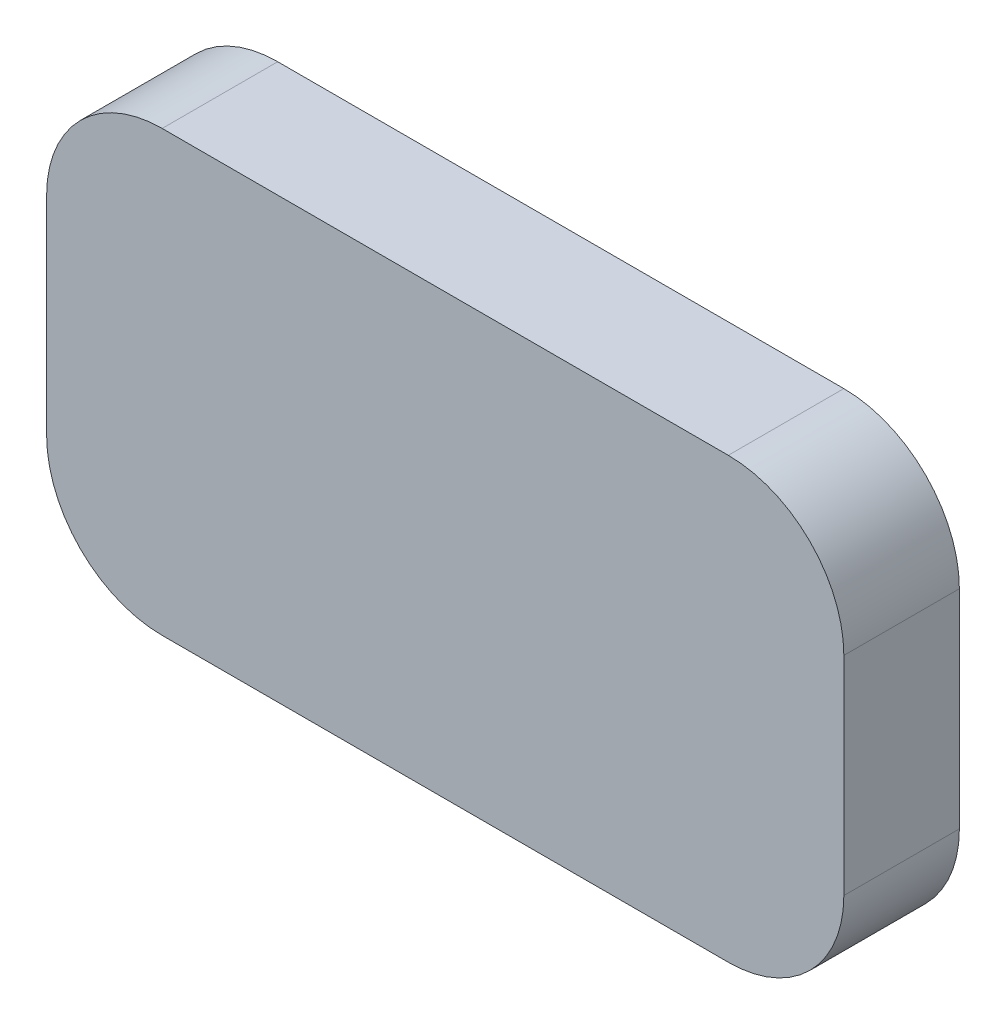
ISO-10303-21;
HEADER;
FILE_DESCRIPTION(('STEP AP214'),'2;1');
FILE_NAME('part.step','',(''),(''),'','','');
FILE_SCHEMA(('AUTOMOTIVE_DESIGN { 1 0 10303 214 1 1 1 1 }'));
ENDSEC;
DATA;
#1=APPLICATION_CONTEXT('core data for automotive mechanical design processes');
#2=APPLICATION_PROTOCOL_DEFINITION('international standard','automotive_design',2000,#1);
#3=PRODUCT_CONTEXT('',#1,'mechanical');
#4=PRODUCT('Part','Part','',(#3));
#5=PRODUCT_RELATED_PRODUCT_CATEGORY('part','',(#4));
#6=PRODUCT_DEFINITION_FORMATION('','',#4);
#7=PRODUCT_DEFINITION_CONTEXT('part definition',#1,'design');
#8=PRODUCT_DEFINITION('design','',#6,#7);
#9=PRODUCT_DEFINITION_SHAPE('','',#8);
#10=(LENGTH_UNIT() NAMED_UNIT(*) SI_UNIT(.MILLI.,.METRE.));
#11=(NAMED_UNIT(*) PLANE_ANGLE_UNIT() SI_UNIT($,.RADIAN.));
#12=(NAMED_UNIT(*) SI_UNIT($,.STERADIAN.) SOLID_ANGLE_UNIT());
#13=UNCERTAINTY_MEASURE_WITH_UNIT(LENGTH_MEASURE(1.E-05),#10,'distance_accuracy_value','');
#14=(GEOMETRIC_REPRESENTATION_CONTEXT(3) GLOBAL_UNCERTAINTY_ASSIGNED_CONTEXT((#13)) GLOBAL_UNIT_ASSIGNED_CONTEXT((#10,
#11,#12)) REPRESENTATION_CONTEXT('',''));
#15=CARTESIAN_POINT('',(0.,0.,0.));
#16=DIRECTION('',(0.,0.,1.));
#17=DIRECTION('',(1.,0.,0.));
#18=AXIS2_PLACEMENT_3D('',#15,#16,#17);
#19=CARTESIAN_POINT('',(0.,0.,10.));
#20=DIRECTION('',(1.,0.,0.));
#21=DIRECTION('',(0.,1.,0.));
#22=AXIS2_PLACEMENT_3D('',#19,#20,#21);
#23=PLANE('',#22);
#24=DIRECTION('',(0.,-1.,0.));
#25=VECTOR('',#24,1.);
#26=CARTESIAN_POINT('',(0.,0.,0.));
#27=LINE('',#26,#25);
#28=CARTESIAN_POINT('',(0.,-10.,0.));
#29=VERTEX_POINT('',#28);
#30=CARTESIAN_POINT('',(0.,-28.,0.));
#31=VERTEX_POINT('',#30);
#32=EDGE_CURVE('E128',#29,#31,#27,.T.);
#33=ORIENTED_EDGE('',*,*,#32,.T.);
#34=DIRECTION('',(0.,0.,-1.));
#35=VECTOR('',#34,1.);
#36=CARTESIAN_POINT('',(0.,-28.,10.));
#37=LINE('',#36,#35);
#38=CARTESIAN_POINT('',(0.,-28.,10.));
#39=VERTEX_POINT('',#38);
#40=EDGE_CURVE('E105',#31,#39,#37,.F.);
#41=ORIENTED_EDGE('',*,*,#40,.T.);
#42=DIRECTION('',(0.,-1.,0.));
#43=VECTOR('',#42,1.);
#44=CARTESIAN_POINT('',(0.,0.,10.));
#45=LINE('',#44,#43);
#46=CARTESIAN_POINT('',(0.,-10.,10.));
#47=VERTEX_POINT('',#46);
#48=EDGE_CURVE('E137',#47,#39,#45,.T.);
#49=ORIENTED_EDGE('',*,*,#48,.F.);
#50=DIRECTION('',(0.,0.,-1.));
#51=VECTOR('',#50,1.);
#52=CARTESIAN_POINT('',(0.,-10.,10.));
#53=LINE('',#52,#51);
#54=EDGE_CURVE('E110',#47,#29,#53,.T.);
#55=ORIENTED_EDGE('',*,*,#54,.T.);
#56=EDGE_LOOP('',(#33,#41,#49,#55));
#57=FACE_BOUND('',#56,.T.);
#58=ADVANCED_FACE('F33',(#57),#23,.F.);
#59=CARTESIAN_POINT('',(0.,-38.,10.));
#60=DIRECTION('',(0.,1.,0.));
#61=DIRECTION('',(0.,0.,1.));
#62=AXIS2_PLACEMENT_3D('',#59,#60,#61);
#63=PLANE('',#62);
#64=DIRECTION('',(1.,0.,0.));
#65=VECTOR('',#64,1.);
#66=CARTESIAN_POINT('',(0.,-38.,10.));
#67=LINE('',#66,#65);
#68=CARTESIAN_POINT('',(10.,-38.,10.));
#69=VERTEX_POINT('',#68);
#70=CARTESIAN_POINT('',(59.,-38.,10.));
#71=VERTEX_POINT('',#70);
#72=EDGE_CURVE('E120',#69,#71,#67,.T.);
#73=ORIENTED_EDGE('',*,*,#72,.F.);
#74=DIRECTION('',(0.,0.,-1.));
#75=VECTOR('',#74,1.);
#76=CARTESIAN_POINT('',(10.,-38.,10.));
#77=LINE('',#76,#75);
#78=CARTESIAN_POINT('',(10.,-38.,0.));
#79=VERTEX_POINT('',#78);
#80=EDGE_CURVE('E104',#69,#79,#77,.T.);
#81=ORIENTED_EDGE('',*,*,#80,.T.);
#82=DIRECTION('',(1.,0.,0.));
#83=VECTOR('',#82,1.);
#84=CARTESIAN_POINT('',(0.,-38.,0.));
#85=LINE('',#84,#83);
#86=CARTESIAN_POINT('',(59.,-38.,0.));
#87=VERTEX_POINT('',#86);
#88=EDGE_CURVE('E117',#79,#87,#85,.T.);
#89=ORIENTED_EDGE('',*,*,#88,.T.);
#90=DIRECTION('',(0.,0.,-1.));
#91=VECTOR('',#90,1.);
#92=CARTESIAN_POINT('',(59.,-38.,10.));
#93=LINE('',#92,#91);
#94=EDGE_CURVE('E122',#87,#71,#93,.F.);
#95=ORIENTED_EDGE('',*,*,#94,.T.);
#96=EDGE_LOOP('',(#73,#81,#89,#95));
#97=FACE_BOUND('',#96,.T.);
#98=ADVANCED_FACE('F116',(#97),#63,.F.);
#99=CARTESIAN_POINT('',(69.,0.,10.));
#100=DIRECTION('',(-1.,0.,0.));
#101=DIRECTION('',(0.,0.,1.));
#102=AXIS2_PLACEMENT_3D('',#99,#100,#101);
#103=PLANE('',#102);
#104=DIRECTION('',(0.,1.,0.));
#105=VECTOR('',#104,1.);
#106=CARTESIAN_POINT('',(69.,0.,10.));
#107=LINE('',#106,#105);
#108=CARTESIAN_POINT('',(69.,-28.,10.));
#109=VERTEX_POINT('',#108);
#110=CARTESIAN_POINT('',(69.,-10.,10.));
#111=VERTEX_POINT('',#110);
#112=EDGE_CURVE('E160',#109,#111,#107,.T.);
#113=ORIENTED_EDGE('',*,*,#112,.F.);
#114=DIRECTION('',(0.,0.,-1.));
#115=VECTOR('',#114,1.);
#116=CARTESIAN_POINT('',(69.,-28.,10.));
#117=LINE('',#116,#115);
#118=CARTESIAN_POINT('',(69.,-28.,0.));
#119=VERTEX_POINT('',#118);
#120=EDGE_CURVE('E11',#109,#119,#117,.T.);
#121=ORIENTED_EDGE('',*,*,#120,.T.);
#122=DIRECTION('',(0.,1.,0.));
#123=VECTOR('',#122,1.);
#124=CARTESIAN_POINT('',(69.,0.,0.));
#125=LINE('',#124,#123);
#126=CARTESIAN_POINT('',(69.,-10.,0.));
#127=VERTEX_POINT('',#126);
#128=EDGE_CURVE('E127',#119,#127,#125,.T.);
#129=ORIENTED_EDGE('',*,*,#128,.T.);
#130=DIRECTION('',(0.,0.,-1.));
#131=VECTOR('',#130,1.);
#132=CARTESIAN_POINT('',(69.,-10.,10.));
#133=LINE('',#132,#131);
#134=EDGE_CURVE('E41',#127,#111,#133,.F.);
#135=ORIENTED_EDGE('',*,*,#134,.T.);
#136=EDGE_LOOP('',(#113,#121,#129,#135));
#137=FACE_BOUND('',#136,.T.);
#138=ADVANCED_FACE('F159',(#137),#103,.F.);
#139=CARTESIAN_POINT('',(0.,0.,10.));
#140=DIRECTION('',(0.,-1.,0.));
#141=DIRECTION('',(0.,0.,-1.));
#142=AXIS2_PLACEMENT_3D('',#139,#140,#141);
#143=PLANE('',#142);
#144=DIRECTION('',(-1.,0.,0.));
#145=VECTOR('',#144,1.);
#146=CARTESIAN_POINT('',(0.,0.,0.));
#147=LINE('',#146,#145);
#148=CARTESIAN_POINT('',(59.,0.,0.));
#149=VERTEX_POINT('',#148);
#150=CARTESIAN_POINT('',(10.,0.,0.));
#151=VERTEX_POINT('',#150);
#152=EDGE_CURVE('E131',#149,#151,#147,.T.);
#153=ORIENTED_EDGE('',*,*,#152,.T.);
#154=DIRECTION('',(0.,0.,-1.));
#155=VECTOR('',#154,1.);
#156=CARTESIAN_POINT('',(10.,0.,10.));
#157=LINE('',#156,#155);
#158=CARTESIAN_POINT('',(10.,0.,10.));
#159=VERTEX_POINT('',#158);
#160=EDGE_CURVE('E48',#151,#159,#157,.F.);
#161=ORIENTED_EDGE('',*,*,#160,.T.);
#162=DIRECTION('',(-1.,0.,0.));
#163=VECTOR('',#162,1.);
#164=CARTESIAN_POINT('',(0.,0.,10.));
#165=LINE('',#164,#163);
#166=CARTESIAN_POINT('',(59.,0.,10.));
#167=VERTEX_POINT('',#166);
#168=EDGE_CURVE('E138',#167,#159,#165,.T.);
#169=ORIENTED_EDGE('',*,*,#168,.F.);
#170=DIRECTION('',(0.,0.,-1.));
#171=VECTOR('',#170,1.);
#172=CARTESIAN_POINT('',(59.,0.,10.));
#173=LINE('',#172,#171);
#174=EDGE_CURVE('E153',#167,#149,#173,.T.);
#175=ORIENTED_EDGE('',*,*,#174,.T.);
#176=EDGE_LOOP('',(#153,#161,#169,#175));
#177=FACE_BOUND('',#176,.T.);
#178=ADVANCED_FACE('F169',(#177),#143,.F.);
#179=CARTESIAN_POINT('',(0.,0.,10.));
#180=DIRECTION('',(0.,0.,1.));
#181=DIRECTION('',(1.,0.,0.));
#182=AXIS2_PLACEMENT_3D('',#179,#180,#181);
#183=PLANE('',#182);
#184=ORIENTED_EDGE('',*,*,#48,.T.);
#185=CARTESIAN_POINT('',(10.,-28.,10.));
#186=DIRECTION('',(0.,0.,1.));
#187=DIRECTION('',(1.,0.,0.));
#188=AXIS2_PLACEMENT_3D('',#185,#186,#187);
#189=CIRCLE('',#188,10.);
#190=EDGE_CURVE('E151',#39,#69,#189,.T.);
#191=ORIENTED_EDGE('',*,*,#190,.T.);
#192=ORIENTED_EDGE('',*,*,#72,.T.);
#193=CARTESIAN_POINT('',(59.,-28.,10.));
#194=DIRECTION('',(0.,0.,1.));
#195=DIRECTION('',(1.,0.,0.));
#196=AXIS2_PLACEMENT_3D('',#193,#194,#195);
#197=CIRCLE('',#196,10.);
#198=EDGE_CURVE('E147',#71,#109,#197,.T.);
#199=ORIENTED_EDGE('',*,*,#198,.T.);
#200=ORIENTED_EDGE('',*,*,#112,.T.);
#201=CARTESIAN_POINT('',(59.,-10.,10.));
#202=DIRECTION('',(0.,0.,1.));
#203=DIRECTION('',(1.,0.,0.));
#204=AXIS2_PLACEMENT_3D('',#201,#202,#203);
#205=CIRCLE('',#204,10.);
#206=EDGE_CURVE('E55',#111,#167,#205,.T.);
#207=ORIENTED_EDGE('',*,*,#206,.T.);
#208=ORIENTED_EDGE('',*,*,#168,.T.);
#209=CARTESIAN_POINT('',(10.,-10.,10.));
#210=DIRECTION('',(0.,0.,1.));
#211=DIRECTION('',(1.,0.,0.));
#212=AXIS2_PLACEMENT_3D('',#209,#210,#211);
#213=CIRCLE('',#212,10.);
#214=EDGE_CURVE('E149',#159,#47,#213,.T.);
#215=ORIENTED_EDGE('',*,*,#214,.T.);
#216=EDGE_LOOP('',(#184,#191,#192,#199,#200,#207,#208,#215));
#217=FACE_BOUND('',#216,.T.);
#218=ADVANCED_FACE('F164',(#217),#183,.T.);
#219=CARTESIAN_POINT('',(0.,0.,0.));
#220=DIRECTION('',(0.,0.,1.));
#221=DIRECTION('',(1.,0.,0.));
#222=AXIS2_PLACEMENT_3D('',#219,#220,#221);
#223=PLANE('',#222);
#224=ORIENTED_EDGE('',*,*,#88,.F.);
#225=CARTESIAN_POINT('',(10.,-28.,0.));
#226=DIRECTION('',(0.,0.,1.));
#227=DIRECTION('',(1.,0.,0.));
#228=AXIS2_PLACEMENT_3D('',#225,#226,#227);
#229=CIRCLE('',#228,10.);
#230=EDGE_CURVE('E100',#79,#31,#229,.F.);
#231=ORIENTED_EDGE('',*,*,#230,.T.);
#232=ORIENTED_EDGE('',*,*,#32,.F.);
#233=CARTESIAN_POINT('',(10.,-10.,0.));
#234=DIRECTION('',(0.,0.,1.));
#235=DIRECTION('',(1.,0.,0.));
#236=AXIS2_PLACEMENT_3D('',#233,#234,#235);
#237=CIRCLE('',#236,10.);
#238=EDGE_CURVE('E111',#29,#151,#237,.F.);
#239=ORIENTED_EDGE('',*,*,#238,.T.);
#240=ORIENTED_EDGE('',*,*,#152,.F.);
#241=CARTESIAN_POINT('',(59.,-10.,0.));
#242=DIRECTION('',(0.,0.,1.));
#243=DIRECTION('',(1.,0.,0.));
#244=AXIS2_PLACEMENT_3D('',#241,#242,#243);
#245=CIRCLE('',#244,10.);
#246=EDGE_CURVE('E121',#149,#127,#245,.F.);
#247=ORIENTED_EDGE('',*,*,#246,.T.);
#248=ORIENTED_EDGE('',*,*,#128,.F.);
#249=CARTESIAN_POINT('',(59.,-28.,0.));
#250=DIRECTION('',(0.,0.,1.));
#251=DIRECTION('',(1.,0.,0.));
#252=AXIS2_PLACEMENT_3D('',#249,#250,#251);
#253=CIRCLE('',#252,10.);
#254=EDGE_CURVE('E126',#119,#87,#253,.F.);
#255=ORIENTED_EDGE('',*,*,#254,.T.);
#256=EDGE_LOOP('',(#224,#231,#232,#239,#240,#247,#248,#255));
#257=FACE_BOUND('',#256,.T.);
#258=ADVANCED_FACE('F124',(#257),#223,.F.);
#259=CARTESIAN_POINT('',(10.,-28.,10.));
#260=DIRECTION('',(0.,0.,-1.));
#261=DIRECTION('',(-1.,0.,0.));
#262=AXIS2_PLACEMENT_3D('',#259,#260,#261);
#263=CYLINDRICAL_SURFACE('',#262,10.);
#264=ORIENTED_EDGE('',*,*,#190,.F.);
#265=ORIENTED_EDGE('',*,*,#40,.F.);
#266=ORIENTED_EDGE('',*,*,#230,.F.);
#267=ORIENTED_EDGE('',*,*,#80,.F.);
#268=EDGE_LOOP('',(#264,#265,#266,#267));
#269=FACE_BOUND('',#268,.T.);
#270=ADVANCED_FACE('F103',(#269),#263,.T.);
#271=CARTESIAN_POINT('',(10.,-10.,10.));
#272=DIRECTION('',(0.,0.,-1.));
#273=DIRECTION('',(-1.,0.,0.));
#274=AXIS2_PLACEMENT_3D('',#271,#272,#273);
#275=CYLINDRICAL_SURFACE('',#274,10.);
#276=ORIENTED_EDGE('',*,*,#214,.F.);
#277=ORIENTED_EDGE('',*,*,#160,.F.);
#278=ORIENTED_EDGE('',*,*,#238,.F.);
#279=ORIENTED_EDGE('',*,*,#54,.F.);
#280=EDGE_LOOP('',(#276,#277,#278,#279));
#281=FACE_BOUND('',#280,.T.);
#282=ADVANCED_FACE('F173',(#281),#275,.T.);
#283=CARTESIAN_POINT('',(59.,-28.,10.));
#284=DIRECTION('',(0.,0.,-1.));
#285=DIRECTION('',(-1.,0.,0.));
#286=AXIS2_PLACEMENT_3D('',#283,#284,#285);
#287=CYLINDRICAL_SURFACE('',#286,10.);
#288=ORIENTED_EDGE('',*,*,#198,.F.);
#289=ORIENTED_EDGE('',*,*,#94,.F.);
#290=ORIENTED_EDGE('',*,*,#254,.F.);
#291=ORIENTED_EDGE('',*,*,#120,.F.);
#292=EDGE_LOOP('',(#288,#289,#290,#291));
#293=FACE_BOUND('',#292,.T.);
#294=ADVANCED_FACE('F179',(#293),#287,.T.);
#295=CARTESIAN_POINT('',(59.,-10.,10.));
#296=DIRECTION('',(0.,0.,-1.));
#297=DIRECTION('',(-1.,0.,0.));
#298=AXIS2_PLACEMENT_3D('',#295,#296,#297);
#299=CYLINDRICAL_SURFACE('',#298,10.);
#300=ORIENTED_EDGE('',*,*,#206,.F.);
#301=ORIENTED_EDGE('',*,*,#134,.F.);
#302=ORIENTED_EDGE('',*,*,#246,.F.);
#303=ORIENTED_EDGE('',*,*,#174,.F.);
#304=EDGE_LOOP('',(#300,#301,#302,#303));
#305=FACE_BOUND('',#304,.T.);
#306=ADVANCED_FACE('F35',(#305),#299,.T.);
#307=CLOSED_SHELL('',(#58,#98,#138,#178,#218,#258,#270,#282,#294,#306));
#308=MANIFOLD_SOLID_BREP('B2',#307);
#309=ADVANCED_BREP_SHAPE_REPRESENTATION('',(#18,#308),#14);
#310=SHAPE_DEFINITION_REPRESENTATION(#9,#309);
ENDSEC;
END-ISO-10303-21;
